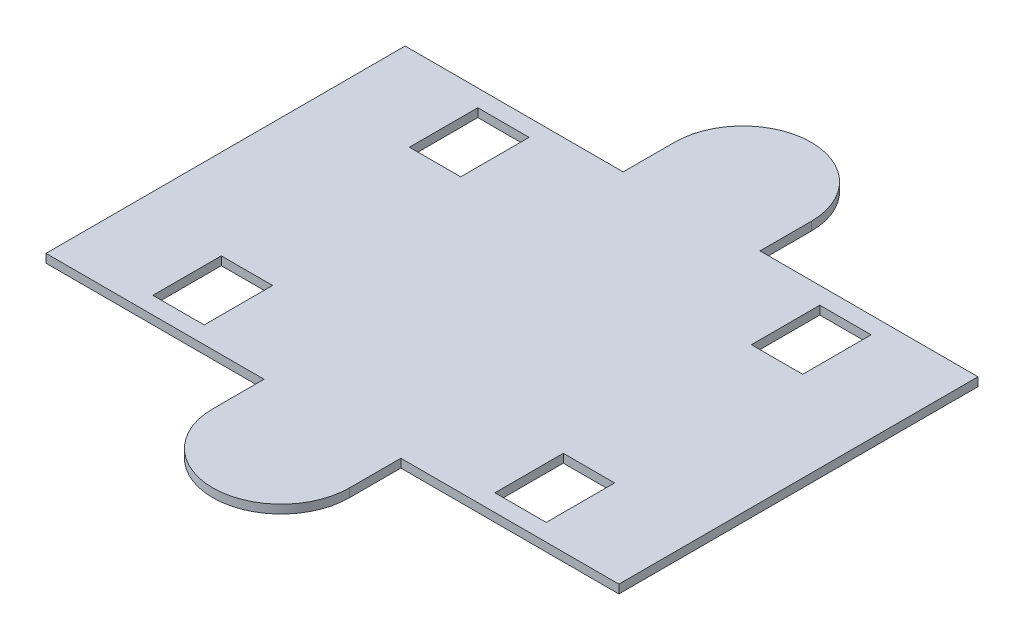
ISO-10303-21;
HEADER;
FILE_DESCRIPTION(('STEP AP214'),'2;1');
FILE_NAME('part.step','',(''),(''),'','','');
FILE_SCHEMA(('AUTOMOTIVE_DESIGN { 1 0 10303 214 1 1 1 1 }'));
ENDSEC;
DATA;
#1=APPLICATION_CONTEXT('core data for automotive mechanical design processes');
#2=APPLICATION_PROTOCOL_DEFINITION('international standard','automotive_design',2000,#1);
#3=PRODUCT_CONTEXT('',#1,'mechanical');
#4=PRODUCT('Part','Part','',(#3));
#5=PRODUCT_RELATED_PRODUCT_CATEGORY('part','',(#4));
#6=PRODUCT_DEFINITION_FORMATION('','',#4);
#7=PRODUCT_DEFINITION_CONTEXT('part definition',#1,'design');
#8=PRODUCT_DEFINITION('design','',#6,#7);
#9=PRODUCT_DEFINITION_SHAPE('','',#8);
#10=(LENGTH_UNIT() NAMED_UNIT(*) SI_UNIT(.MILLI.,.METRE.));
#11=(NAMED_UNIT(*) PLANE_ANGLE_UNIT() SI_UNIT($,.RADIAN.));
#12=(NAMED_UNIT(*) SI_UNIT($,.STERADIAN.) SOLID_ANGLE_UNIT());
#13=UNCERTAINTY_MEASURE_WITH_UNIT(LENGTH_MEASURE(1.E-05),#10,'distance_accuracy_value','');
#14=(GEOMETRIC_REPRESENTATION_CONTEXT(3) GLOBAL_UNCERTAINTY_ASSIGNED_CONTEXT((#13)) GLOBAL_UNIT_ASSIGNED_CONTEXT((#10,
#11,#12)) REPRESENTATION_CONTEXT('',''));
#15=CARTESIAN_POINT('',(0.,0.,0.));
#16=DIRECTION('',(0.,0.,1.));
#17=DIRECTION('',(1.,0.,0.));
#18=AXIS2_PLACEMENT_3D('',#15,#16,#17);
#19=CARTESIAN_POINT('',(-106.3625,0.,66.675));
#20=DIRECTION('',(0.,0.,1.));
#21=DIRECTION('',(1.,0.,0.));
#22=AXIS2_PLACEMENT_3D('',#19,#20,#21);
#23=PLANE('',#22);
#24=DIRECTION('',(1.,0.,0.));
#25=VECTOR('',#24,1.);
#26=CARTESIAN_POINT('',(-106.3625,0.,66.675));
#27=LINE('',#26,#25);
#28=CARTESIAN_POINT('',(-106.3625,0.,66.675));
#29=VERTEX_POINT('',#28);
#30=CARTESIAN_POINT('',(-25.4,0.,66.675));
#31=VERTEX_POINT('',#30);
#32=EDGE_CURVE('E284',#29,#31,#27,.T.);
#33=ORIENTED_EDGE('',*,*,#32,.T.);
#34=DIRECTION('',(0.,1.,0.));
#35=VECTOR('',#34,1.);
#36=CARTESIAN_POINT('',(-25.4,0.,66.675));
#37=LINE('',#36,#35);
#38=CARTESIAN_POINT('',(-25.4,3.175,66.675));
#39=VERTEX_POINT('',#38);
#40=EDGE_CURVE('E248',#31,#39,#37,.T.);
#41=ORIENTED_EDGE('',*,*,#40,.T.);
#42=DIRECTION('',(1.,0.,0.));
#43=VECTOR('',#42,1.);
#44=CARTESIAN_POINT('',(-106.3625,3.175,66.675));
#45=LINE('',#44,#43);
#46=CARTESIAN_POINT('',(-106.3625,3.175,66.675));
#47=VERTEX_POINT('',#46);
#48=EDGE_CURVE('E273',#47,#39,#45,.T.);
#49=ORIENTED_EDGE('',*,*,#48,.F.);
#50=DIRECTION('',(0.,1.,0.));
#51=VECTOR('',#50,1.);
#52=CARTESIAN_POINT('',(-106.3625,0.,66.675));
#53=LINE('',#52,#51);
#54=EDGE_CURVE('E293',#29,#47,#53,.T.);
#55=ORIENTED_EDGE('',*,*,#54,.F.);
#56=EDGE_LOOP('',(#33,#41,#49,#55));
#57=FACE_BOUND('',#56,.T.);
#58=ADVANCED_FACE('F32',(#57),#23,.T.);
#59=CARTESIAN_POINT('',(-106.3625,0.,-66.675));
#60=DIRECTION('',(0.,0.,-1.));
#61=DIRECTION('',(-1.,0.,0.));
#62=AXIS2_PLACEMENT_3D('',#59,#60,#61);
#63=PLANE('',#62);
#64=DIRECTION('',(-1.,0.,0.));
#65=VECTOR('',#64,1.);
#66=CARTESIAN_POINT('',(-106.3625,0.,-66.675));
#67=LINE('',#66,#65);
#68=CARTESIAN_POINT('',(106.3625,0.,-66.675));
#69=VERTEX_POINT('',#68);
#70=CARTESIAN_POINT('',(25.4,0.,-66.675));
#71=VERTEX_POINT('',#70);
#72=EDGE_CURVE('E440',#69,#71,#67,.T.);
#73=ORIENTED_EDGE('',*,*,#72,.T.);
#74=DIRECTION('',(0.,1.,0.));
#75=VECTOR('',#74,1.);
#76=CARTESIAN_POINT('',(25.4,0.,-66.675));
#77=LINE('',#76,#75);
#78=CARTESIAN_POINT('',(25.4,3.175,-66.675));
#79=VERTEX_POINT('',#78);
#80=EDGE_CURVE('E432',#71,#79,#77,.T.);
#81=ORIENTED_EDGE('',*,*,#80,.T.);
#82=DIRECTION('',(-1.,0.,0.));
#83=VECTOR('',#82,1.);
#84=CARTESIAN_POINT('',(-106.3625,3.175,-66.675));
#85=LINE('',#84,#83);
#86=CARTESIAN_POINT('',(106.3625,3.175,-66.675));
#87=VERTEX_POINT('',#86);
#88=EDGE_CURVE('E279',#87,#79,#85,.T.);
#89=ORIENTED_EDGE('',*,*,#88,.F.);
#90=DIRECTION('',(0.,1.,0.));
#91=VECTOR('',#90,1.);
#92=CARTESIAN_POINT('',(106.3625,0.,-66.675));
#93=LINE('',#92,#91);
#94=EDGE_CURVE('E298',#69,#87,#93,.T.);
#95=ORIENTED_EDGE('',*,*,#94,.F.);
#96=EDGE_LOOP('',(#73,#81,#89,#95));
#97=FACE_BOUND('',#96,.T.);
#98=ADVANCED_FACE('F498',(#97),#63,.T.);
#99=CARTESIAN_POINT('',(0.,3.175,0.));
#100=DIRECTION('',(0.,1.,0.));
#101=DIRECTION('',(0.,0.,1.));
#102=AXIS2_PLACEMENT_3D('',#99,#100,#101);
#103=PLANE('',#102);
#104=DIRECTION('',(0.,0.,-1.));
#105=VECTOR('',#104,1.);
#106=CARTESIAN_POINT('',(-53.975,3.175,-60.325));
#107=LINE('',#106,#105);
#108=CARTESIAN_POINT('',(-53.975,3.175,-34.925));
#109=VERTEX_POINT('',#108);
#110=CARTESIAN_POINT('',(-53.975,3.175,-60.325));
#111=VERTEX_POINT('',#110);
#112=EDGE_CURVE('E389',#109,#111,#107,.T.);
#113=ORIENTED_EDGE('',*,*,#112,.F.);
#114=DIRECTION('',(1.,0.,0.));
#115=VECTOR('',#114,1.);
#116=CARTESIAN_POINT('',(-73.025,3.175,-34.925));
#117=LINE('',#116,#115);
#118=CARTESIAN_POINT('',(-73.025,3.175,-34.925));
#119=VERTEX_POINT('',#118);
#120=EDGE_CURVE('E400',#119,#109,#117,.T.);
#121=ORIENTED_EDGE('',*,*,#120,.F.);
#122=DIRECTION('',(0.,0.,1.));
#123=VECTOR('',#122,1.);
#124=CARTESIAN_POINT('',(-73.025,3.175,-60.325));
#125=LINE('',#124,#123);
#126=CARTESIAN_POINT('',(-73.025,3.175,-60.325));
#127=VERTEX_POINT('',#126);
#128=EDGE_CURVE('E414',#127,#119,#125,.T.);
#129=ORIENTED_EDGE('',*,*,#128,.F.);
#130=DIRECTION('',(-1.,0.,0.));
#131=VECTOR('',#130,1.);
#132=CARTESIAN_POINT('',(-73.025,3.175,-60.325));
#133=LINE('',#132,#131);
#134=EDGE_CURVE('E411',#111,#127,#133,.T.);
#135=ORIENTED_EDGE('',*,*,#134,.F.);
#136=EDGE_LOOP('',(#113,#121,#129,#135));
#137=FACE_BOUND('',#136,.T.);
#138=DIRECTION('',(0.,0.,1.));
#139=VECTOR('',#138,1.);
#140=CARTESIAN_POINT('',(-73.025,3.175,60.325));
#141=LINE('',#140,#139);
#142=CARTESIAN_POINT('',(-73.025,3.175,34.925));
#143=VERTEX_POINT('',#142);
#144=CARTESIAN_POINT('',(-73.025,3.175,60.325));
#145=VERTEX_POINT('',#144);
#146=EDGE_CURVE('E357',#143,#145,#141,.T.);
#147=ORIENTED_EDGE('',*,*,#146,.F.);
#148=DIRECTION('',(-1.,0.,0.));
#149=VECTOR('',#148,1.);
#150=CARTESIAN_POINT('',(-73.025,3.175,34.925));
#151=LINE('',#150,#149);
#152=CARTESIAN_POINT('',(-53.975,3.175,34.925));
#153=VERTEX_POINT('',#152);
#154=EDGE_CURVE('E368',#153,#143,#151,.T.);
#155=ORIENTED_EDGE('',*,*,#154,.F.);
#156=DIRECTION('',(0.,0.,-1.));
#157=VECTOR('',#156,1.);
#158=CARTESIAN_POINT('',(-53.975,3.175,60.325));
#159=LINE('',#158,#157);
#160=CARTESIAN_POINT('',(-53.975,3.175,60.325));
#161=VERTEX_POINT('',#160);
#162=EDGE_CURVE('E382',#161,#153,#159,.T.);
#163=ORIENTED_EDGE('',*,*,#162,.F.);
#164=DIRECTION('',(1.,0.,0.));
#165=VECTOR('',#164,1.);
#166=CARTESIAN_POINT('',(-73.025,3.175,60.325));
#167=LINE('',#166,#165);
#168=EDGE_CURVE('E379',#145,#161,#167,.T.);
#169=ORIENTED_EDGE('',*,*,#168,.F.);
#170=EDGE_LOOP('',(#147,#155,#163,#169));
#171=FACE_BOUND('',#170,.T.);
#172=DIRECTION('',(0.,0.,-1.));
#173=VECTOR('',#172,1.);
#174=CARTESIAN_POINT('',(73.025,3.175,60.325));
#175=LINE('',#174,#173);
#176=CARTESIAN_POINT('',(73.025,3.175,60.325));
#177=VERTEX_POINT('',#176);
#178=CARTESIAN_POINT('',(73.025,3.175,34.925));
#179=VERTEX_POINT('',#178);
#180=EDGE_CURVE('E325',#177,#179,#175,.T.);
#181=ORIENTED_EDGE('',*,*,#180,.F.);
#182=DIRECTION('',(1.,0.,0.));
#183=VECTOR('',#182,1.);
#184=CARTESIAN_POINT('',(73.025,3.175,60.325));
#185=LINE('',#184,#183);
#186=CARTESIAN_POINT('',(53.975,3.175,60.325));
#187=VERTEX_POINT('',#186);
#188=EDGE_CURVE('E336',#187,#177,#185,.T.);
#189=ORIENTED_EDGE('',*,*,#188,.F.);
#190=DIRECTION('',(0.,0.,1.));
#191=VECTOR('',#190,1.);
#192=CARTESIAN_POINT('',(53.975,3.175,60.325));
#193=LINE('',#192,#191);
#194=CARTESIAN_POINT('',(53.975,3.175,34.925));
#195=VERTEX_POINT('',#194);
#196=EDGE_CURVE('E350',#195,#187,#193,.T.);
#197=ORIENTED_EDGE('',*,*,#196,.F.);
#198=DIRECTION('',(-1.,0.,0.));
#199=VECTOR('',#198,1.);
#200=CARTESIAN_POINT('',(73.025,3.175,34.925));
#201=LINE('',#200,#199);
#202=EDGE_CURVE('E347',#179,#195,#201,.T.);
#203=ORIENTED_EDGE('',*,*,#202,.F.);
#204=EDGE_LOOP('',(#181,#189,#197,#203));
#205=FACE_BOUND('',#204,.T.);
#206=DIRECTION('',(0.,0.,-1.));
#207=VECTOR('',#206,1.);
#208=CARTESIAN_POINT('',(73.025,3.175,-60.325));
#209=LINE('',#208,#207);
#210=CARTESIAN_POINT('',(73.025,3.175,-34.925));
#211=VERTEX_POINT('',#210);
#212=CARTESIAN_POINT('',(73.025,3.175,-60.325));
#213=VERTEX_POINT('',#212);
#214=EDGE_CURVE('E292',#211,#213,#209,.T.);
#215=ORIENTED_EDGE('',*,*,#214,.F.);
#216=DIRECTION('',(1.,0.,0.));
#217=VECTOR('',#216,1.);
#218=CARTESIAN_POINT('',(73.025,3.175,-34.925));
#219=LINE('',#218,#217);
#220=CARTESIAN_POINT('',(53.975,3.175,-34.925));
#221=VERTEX_POINT('',#220);
#222=EDGE_CURVE('E304',#221,#211,#219,.T.);
#223=ORIENTED_EDGE('',*,*,#222,.F.);
#224=DIRECTION('',(0.,0.,1.));
#225=VECTOR('',#224,1.);
#226=CARTESIAN_POINT('',(53.975,3.175,-60.325));
#227=LINE('',#226,#225);
#228=CARTESIAN_POINT('',(53.975,3.175,-60.325));
#229=VERTEX_POINT('',#228);
#230=EDGE_CURVE('E318',#229,#221,#227,.T.);
#231=ORIENTED_EDGE('',*,*,#230,.F.);
#232=DIRECTION('',(-1.,0.,0.));
#233=VECTOR('',#232,1.);
#234=CARTESIAN_POINT('',(73.025,3.175,-60.325));
#235=LINE('',#234,#233);
#236=EDGE_CURVE('E315',#213,#229,#235,.T.);
#237=ORIENTED_EDGE('',*,*,#236,.F.);
#238=EDGE_LOOP('',(#215,#223,#231,#237));
#239=FACE_BOUND('',#238,.T.);
#240=ORIENTED_EDGE('',*,*,#48,.T.);
#241=DIRECTION('',(0.,0.,1.));
#242=VECTOR('',#241,1.);
#243=CARTESIAN_POINT('',(-25.4,3.175,66.675));
#244=LINE('',#243,#242);
#245=CARTESIAN_POINT('',(-25.4,3.175,85.725));
#246=VERTEX_POINT('',#245);
#247=EDGE_CURVE('E49',#39,#246,#244,.T.);
#248=ORIENTED_EDGE('',*,*,#247,.T.);
#249=CARTESIAN_POINT('',(0.,3.175,85.725));
#250=DIRECTION('',(0.,1.,0.));
#251=DIRECTION('',(0.,0.,-1.));
#252=AXIS2_PLACEMENT_3D('',#249,#250,#251);
#253=CIRCLE('',#252,25.4);
#254=CARTESIAN_POINT('',(25.4,3.175,85.725));
#255=VERTEX_POINT('',#254);
#256=EDGE_CURVE('E245',#246,#255,#253,.T.);
#257=ORIENTED_EDGE('',*,*,#256,.T.);
#258=DIRECTION('',(0.,0.,-1.));
#259=VECTOR('',#258,1.);
#260=CARTESIAN_POINT('',(25.4,3.175,66.675));
#261=LINE('',#260,#259);
#262=CARTESIAN_POINT('',(25.4,3.175,66.675));
#263=VERTEX_POINT('',#262);
#264=EDGE_CURVE('E223',#255,#263,#261,.T.);
#265=ORIENTED_EDGE('',*,*,#264,.T.);
#266=CARTESIAN_POINT('',(106.3625,3.175,66.675));
#267=VERTEX_POINT('',#266);
#268=EDGE_CURVE('E266',#263,#267,#45,.T.);
#269=ORIENTED_EDGE('',*,*,#268,.T.);
#270=DIRECTION('',(0.,0.,-1.));
#271=VECTOR('',#270,1.);
#272=CARTESIAN_POINT('',(106.3625,3.175,66.675));
#273=LINE('',#272,#271);
#274=EDGE_CURVE('E430',#267,#87,#273,.T.);
#275=ORIENTED_EDGE('',*,*,#274,.T.);
#276=ORIENTED_EDGE('',*,*,#88,.T.);
#277=DIRECTION('',(0.,0.,-1.));
#278=VECTOR('',#277,1.);
#279=CARTESIAN_POINT('',(25.4,3.175,-66.675));
#280=LINE('',#279,#278);
#281=CARTESIAN_POINT('',(25.4,3.175,-85.725));
#282=VERTEX_POINT('',#281);
#283=EDGE_CURVE('E57',#79,#282,#280,.T.);
#284=ORIENTED_EDGE('',*,*,#283,.T.);
#285=CARTESIAN_POINT('',(0.,3.175,-85.725));
#286=DIRECTION('',(0.,1.,0.));
#287=DIRECTION('',(0.,0.,1.));
#288=AXIS2_PLACEMENT_3D('',#285,#286,#287);
#289=CIRCLE('',#288,25.4);
#290=CARTESIAN_POINT('',(-25.4,3.175,-85.725));
#291=VERTEX_POINT('',#290);
#292=EDGE_CURVE('E478',#282,#291,#289,.T.);
#293=ORIENTED_EDGE('',*,*,#292,.T.);
#294=DIRECTION('',(0.,0.,1.));
#295=VECTOR('',#294,1.);
#296=CARTESIAN_POINT('',(-25.4,3.175,-66.675));
#297=LINE('',#296,#295);
#298=CARTESIAN_POINT('',(-25.4,3.175,-66.675));
#299=VERTEX_POINT('',#298);
#300=EDGE_CURVE('E475',#291,#299,#297,.T.);
#301=ORIENTED_EDGE('',*,*,#300,.T.);
#302=CARTESIAN_POINT('',(-106.3625,3.175,-66.675));
#303=VERTEX_POINT('',#302);
#304=EDGE_CURVE('E426',#299,#303,#85,.T.);
#305=ORIENTED_EDGE('',*,*,#304,.T.);
#306=DIRECTION('',(0.,0.,1.));
#307=VECTOR('',#306,1.);
#308=CARTESIAN_POINT('',(-106.3625,3.175,66.675));
#309=LINE('',#308,#307);
#310=EDGE_CURVE('E274',#303,#47,#309,.T.);
#311=ORIENTED_EDGE('',*,*,#310,.T.);
#312=EDGE_LOOP('',(#240,#248,#257,#265,#269,#275,#276,#284,#293,#301,#305,#311));
#313=FACE_BOUND('',#312,.T.);
#314=ADVANCED_FACE('F264',(#137,#171,#205,#239,#313),#103,.T.);
#315=CARTESIAN_POINT('',(0.,0.,0.));
#316=DIRECTION('',(0.,1.,0.));
#317=DIRECTION('',(0.,0.,1.));
#318=AXIS2_PLACEMENT_3D('',#315,#316,#317);
#319=PLANE('',#318);
#320=DIRECTION('',(1.,0.,0.));
#321=VECTOR('',#320,1.);
#322=CARTESIAN_POINT('',(-73.025,0.,-34.925));
#323=LINE('',#322,#321);
#324=CARTESIAN_POINT('',(-73.025,0.,-34.925));
#325=VERTEX_POINT('',#324);
#326=CARTESIAN_POINT('',(-53.975,0.,-34.925));
#327=VERTEX_POINT('',#326);
#328=EDGE_CURVE('E406',#325,#327,#323,.T.);
#329=ORIENTED_EDGE('',*,*,#328,.T.);
#330=DIRECTION('',(0.,0.,-1.));
#331=VECTOR('',#330,1.);
#332=CARTESIAN_POINT('',(-53.975,0.,-60.325));
#333=LINE('',#332,#331);
#334=CARTESIAN_POINT('',(-53.975,0.,-60.325));
#335=VERTEX_POINT('',#334);
#336=EDGE_CURVE('E396',#327,#335,#333,.T.);
#337=ORIENTED_EDGE('',*,*,#336,.T.);
#338=DIRECTION('',(-1.,0.,0.));
#339=VECTOR('',#338,1.);
#340=CARTESIAN_POINT('',(-73.025,0.,-60.325));
#341=LINE('',#340,#339);
#342=CARTESIAN_POINT('',(-73.025,0.,-60.325));
#343=VERTEX_POINT('',#342);
#344=EDGE_CURVE('E399',#335,#343,#341,.T.);
#345=ORIENTED_EDGE('',*,*,#344,.T.);
#346=DIRECTION('',(0.,0.,1.));
#347=VECTOR('',#346,1.);
#348=CARTESIAN_POINT('',(-73.025,0.,-60.325));
#349=LINE('',#348,#347);
#350=EDGE_CURVE('E403',#343,#325,#349,.T.);
#351=ORIENTED_EDGE('',*,*,#350,.T.);
#352=EDGE_LOOP('',(#329,#337,#345,#351));
#353=FACE_BOUND('',#352,.T.);
#354=DIRECTION('',(-1.,0.,0.));
#355=VECTOR('',#354,1.);
#356=CARTESIAN_POINT('',(-73.025,0.,34.925));
#357=LINE('',#356,#355);
#358=CARTESIAN_POINT('',(-53.975,0.,34.925));
#359=VERTEX_POINT('',#358);
#360=CARTESIAN_POINT('',(-73.025,0.,34.925));
#361=VERTEX_POINT('',#360);
#362=EDGE_CURVE('E374',#359,#361,#357,.T.);
#363=ORIENTED_EDGE('',*,*,#362,.T.);
#364=DIRECTION('',(0.,0.,1.));
#365=VECTOR('',#364,1.);
#366=CARTESIAN_POINT('',(-73.025,0.,60.325));
#367=LINE('',#366,#365);
#368=CARTESIAN_POINT('',(-73.025,0.,60.325));
#369=VERTEX_POINT('',#368);
#370=EDGE_CURVE('E364',#361,#369,#367,.T.);
#371=ORIENTED_EDGE('',*,*,#370,.T.);
#372=DIRECTION('',(1.,0.,0.));
#373=VECTOR('',#372,1.);
#374=CARTESIAN_POINT('',(-73.025,0.,60.325));
#375=LINE('',#374,#373);
#376=CARTESIAN_POINT('',(-53.975,0.,60.325));
#377=VERTEX_POINT('',#376);
#378=EDGE_CURVE('E367',#369,#377,#375,.T.);
#379=ORIENTED_EDGE('',*,*,#378,.T.);
#380=DIRECTION('',(0.,0.,-1.));
#381=VECTOR('',#380,1.);
#382=CARTESIAN_POINT('',(-53.975,0.,60.325));
#383=LINE('',#382,#381);
#384=EDGE_CURVE('E371',#377,#359,#383,.T.);
#385=ORIENTED_EDGE('',*,*,#384,.T.);
#386=EDGE_LOOP('',(#363,#371,#379,#385));
#387=FACE_BOUND('',#386,.T.);
#388=DIRECTION('',(1.,0.,0.));
#389=VECTOR('',#388,1.);
#390=CARTESIAN_POINT('',(73.025,0.,60.325));
#391=LINE('',#390,#389);
#392=CARTESIAN_POINT('',(53.975,0.,60.325));
#393=VERTEX_POINT('',#392);
#394=CARTESIAN_POINT('',(73.025,0.,60.325));
#395=VERTEX_POINT('',#394);
#396=EDGE_CURVE('E342',#393,#395,#391,.T.);
#397=ORIENTED_EDGE('',*,*,#396,.T.);
#398=DIRECTION('',(0.,0.,-1.));
#399=VECTOR('',#398,1.);
#400=CARTESIAN_POINT('',(73.025,0.,60.325));
#401=LINE('',#400,#399);
#402=CARTESIAN_POINT('',(73.025,0.,34.925));
#403=VERTEX_POINT('',#402);
#404=EDGE_CURVE('E332',#395,#403,#401,.T.);
#405=ORIENTED_EDGE('',*,*,#404,.T.);
#406=DIRECTION('',(-1.,0.,0.));
#407=VECTOR('',#406,1.);
#408=CARTESIAN_POINT('',(73.025,0.,34.925));
#409=LINE('',#408,#407);
#410=CARTESIAN_POINT('',(53.975,0.,34.925));
#411=VERTEX_POINT('',#410);
#412=EDGE_CURVE('E335',#403,#411,#409,.T.);
#413=ORIENTED_EDGE('',*,*,#412,.T.);
#414=DIRECTION('',(0.,0.,1.));
#415=VECTOR('',#414,1.);
#416=CARTESIAN_POINT('',(53.975,0.,60.325));
#417=LINE('',#416,#415);
#418=EDGE_CURVE('E339',#411,#393,#417,.T.);
#419=ORIENTED_EDGE('',*,*,#418,.T.);
#420=EDGE_LOOP('',(#397,#405,#413,#419));
#421=FACE_BOUND('',#420,.T.);
#422=DIRECTION('',(1.,0.,0.));
#423=VECTOR('',#422,1.);
#424=CARTESIAN_POINT('',(73.025,0.,-34.925));
#425=LINE('',#424,#423);
#426=CARTESIAN_POINT('',(53.975,0.,-34.925));
#427=VERTEX_POINT('',#426);
#428=CARTESIAN_POINT('',(73.025,0.,-34.925));
#429=VERTEX_POINT('',#428);
#430=EDGE_CURVE('E310',#427,#429,#425,.T.);
#431=ORIENTED_EDGE('',*,*,#430,.T.);
#432=DIRECTION('',(0.,0.,-1.));
#433=VECTOR('',#432,1.);
#434=CARTESIAN_POINT('',(73.025,0.,-60.325));
#435=LINE('',#434,#433);
#436=CARTESIAN_POINT('',(73.025,0.,-60.325));
#437=VERTEX_POINT('',#436);
#438=EDGE_CURVE('E300',#429,#437,#435,.T.);
#439=ORIENTED_EDGE('',*,*,#438,.T.);
#440=DIRECTION('',(-1.,0.,0.));
#441=VECTOR('',#440,1.);
#442=CARTESIAN_POINT('',(73.025,0.,-60.325));
#443=LINE('',#442,#441);
#444=CARTESIAN_POINT('',(53.975,0.,-60.325));
#445=VERTEX_POINT('',#444);
#446=EDGE_CURVE('E303',#437,#445,#443,.T.);
#447=ORIENTED_EDGE('',*,*,#446,.T.);
#448=DIRECTION('',(0.,0.,1.));
#449=VECTOR('',#448,1.);
#450=CARTESIAN_POINT('',(53.975,0.,-60.325));
#451=LINE('',#450,#449);
#452=EDGE_CURVE('E307',#445,#427,#451,.T.);
#453=ORIENTED_EDGE('',*,*,#452,.T.);
#454=EDGE_LOOP('',(#431,#439,#447,#453));
#455=FACE_BOUND('',#454,.T.);
#456=DIRECTION('',(0.,0.,-1.));
#457=VECTOR('',#456,1.);
#458=CARTESIAN_POINT('',(106.3625,0.,66.675));
#459=LINE('',#458,#457);
#460=CARTESIAN_POINT('',(106.3625,0.,66.675));
#461=VERTEX_POINT('',#460);
#462=EDGE_CURVE('E276',#461,#69,#459,.T.);
#463=ORIENTED_EDGE('',*,*,#462,.F.);
#464=CARTESIAN_POINT('',(25.4,0.,66.675));
#465=VERTEX_POINT('',#464);
#466=EDGE_CURVE('E238',#465,#461,#27,.T.);
#467=ORIENTED_EDGE('',*,*,#466,.F.);
#468=DIRECTION('',(0.,0.,-1.));
#469=VECTOR('',#468,1.);
#470=CARTESIAN_POINT('',(25.4,0.,66.675));
#471=LINE('',#470,#469);
#472=CARTESIAN_POINT('',(25.4,0.,85.725));
#473=VERTEX_POINT('',#472);
#474=EDGE_CURVE('E220',#473,#465,#471,.T.);
#475=ORIENTED_EDGE('',*,*,#474,.F.);
#476=CARTESIAN_POINT('',(0.,0.,85.725));
#477=DIRECTION('',(0.,1.,0.));
#478=DIRECTION('',(0.,0.,-1.));
#479=AXIS2_PLACEMENT_3D('',#476,#477,#478);
#480=CIRCLE('',#479,25.4);
#481=CARTESIAN_POINT('',(-25.4,0.,85.725));
#482=VERTEX_POINT('',#481);
#483=EDGE_CURVE('E236',#482,#473,#480,.T.);
#484=ORIENTED_EDGE('',*,*,#483,.F.);
#485=DIRECTION('',(0.,0.,1.));
#486=VECTOR('',#485,1.);
#487=CARTESIAN_POINT('',(-25.4,0.,66.675));
#488=LINE('',#487,#486);
#489=EDGE_CURVE('E229',#31,#482,#488,.T.);
#490=ORIENTED_EDGE('',*,*,#489,.F.);
#491=ORIENTED_EDGE('',*,*,#32,.F.);
#492=DIRECTION('',(0.,0.,1.));
#493=VECTOR('',#492,1.);
#494=CARTESIAN_POINT('',(-106.3625,0.,66.675));
#495=LINE('',#494,#493);
#496=CARTESIAN_POINT('',(-106.3625,0.,-66.675));
#497=VERTEX_POINT('',#496);
#498=EDGE_CURVE('E435',#497,#29,#495,.T.);
#499=ORIENTED_EDGE('',*,*,#498,.F.);
#500=CARTESIAN_POINT('',(-25.4,0.,-66.675));
#501=VERTEX_POINT('',#500);
#502=EDGE_CURVE('E446',#501,#497,#67,.T.);
#503=ORIENTED_EDGE('',*,*,#502,.F.);
#504=DIRECTION('',(0.,0.,1.));
#505=VECTOR('',#504,1.);
#506=CARTESIAN_POINT('',(-25.4,0.,-66.675));
#507=LINE('',#506,#505);
#508=CARTESIAN_POINT('',(-25.4,0.,-85.725));
#509=VERTEX_POINT('',#508);
#510=EDGE_CURVE('E459',#509,#501,#507,.T.);
#511=ORIENTED_EDGE('',*,*,#510,.F.);
#512=CARTESIAN_POINT('',(0.,0.,-85.725));
#513=DIRECTION('',(0.,1.,0.));
#514=DIRECTION('',(0.,0.,1.));
#515=AXIS2_PLACEMENT_3D('',#512,#513,#514);
#516=CIRCLE('',#515,25.4);
#517=CARTESIAN_POINT('',(25.4,0.,-85.725));
#518=VERTEX_POINT('',#517);
#519=EDGE_CURVE('E472',#518,#509,#516,.T.);
#520=ORIENTED_EDGE('',*,*,#519,.F.);
#521=DIRECTION('',(0.,0.,-1.));
#522=VECTOR('',#521,1.);
#523=CARTESIAN_POINT('',(25.4,0.,-66.675));
#524=LINE('',#523,#522);
#525=EDGE_CURVE('E477',#71,#518,#524,.T.);
#526=ORIENTED_EDGE('',*,*,#525,.F.);
#527=ORIENTED_EDGE('',*,*,#72,.F.);
#528=EDGE_LOOP('',(#463,#467,#475,#484,#490,#491,#499,#503,#511,#520,#526,#527));
#529=FACE_BOUND('',#528,.T.);
#530=ADVANCED_FACE('F34',(#353,#387,#421,#455,#529),#319,.F.);
#531=CARTESIAN_POINT('',(-53.975,0.,-60.325));
#532=DIRECTION('',(1.,0.,0.));
#533=DIRECTION('',(0.,0.,-1.));
#534=AXIS2_PLACEMENT_3D('',#531,#532,#533);
#535=PLANE('',#534);
#536=ORIENTED_EDGE('',*,*,#112,.T.);
#537=DIRECTION('',(0.,1.,0.));
#538=VECTOR('',#537,1.);
#539=CARTESIAN_POINT('',(-53.975,0.,-60.325));
#540=LINE('',#539,#538);
#541=EDGE_CURVE('E409',#335,#111,#540,.T.);
#542=ORIENTED_EDGE('',*,*,#541,.F.);
#543=ORIENTED_EDGE('',*,*,#336,.F.);
#544=DIRECTION('',(0.,1.,0.));
#545=VECTOR('',#544,1.);
#546=CARTESIAN_POINT('',(-53.975,0.,-34.925));
#547=LINE('',#546,#545);
#548=EDGE_CURVE('E12',#327,#109,#547,.T.);
#549=ORIENTED_EDGE('',*,*,#548,.T.);
#550=EDGE_LOOP('',(#536,#542,#543,#549));
#551=FACE_BOUND('',#550,.T.);
#552=ADVANCED_FACE('F586',(#551),#535,.F.);
#553=CARTESIAN_POINT('',(-73.025,0.,-34.925));
#554=DIRECTION('',(0.,0.,1.));
#555=DIRECTION('',(1.,0.,0.));
#556=AXIS2_PLACEMENT_3D('',#553,#554,#555);
#557=PLANE('',#556);
#558=ORIENTED_EDGE('',*,*,#120,.T.);
#559=ORIENTED_EDGE('',*,*,#548,.F.);
#560=ORIENTED_EDGE('',*,*,#328,.F.);
#561=DIRECTION('',(0.,1.,0.));
#562=VECTOR('',#561,1.);
#563=CARTESIAN_POINT('',(-73.025,0.,-34.925));
#564=LINE('',#563,#562);
#565=EDGE_CURVE('E41',#325,#119,#564,.T.);
#566=ORIENTED_EDGE('',*,*,#565,.T.);
#567=EDGE_LOOP('',(#558,#559,#560,#566));
#568=FACE_BOUND('',#567,.T.);
#569=ADVANCED_FACE('F768',(#568),#557,.F.);
#570=CARTESIAN_POINT('',(-73.025,0.,-60.325));
#571=DIRECTION('',(-1.,0.,0.));
#572=DIRECTION('',(0.,0.,1.));
#573=AXIS2_PLACEMENT_3D('',#570,#571,#572);
#574=PLANE('',#573);
#575=ORIENTED_EDGE('',*,*,#128,.T.);
#576=ORIENTED_EDGE('',*,*,#565,.F.);
#577=ORIENTED_EDGE('',*,*,#350,.F.);
#578=DIRECTION('',(0.,1.,0.));
#579=VECTOR('',#578,1.);
#580=CARTESIAN_POINT('',(-73.025,0.,-60.325));
#581=LINE('',#580,#579);
#582=EDGE_CURVE('E420',#343,#127,#581,.T.);
#583=ORIENTED_EDGE('',*,*,#582,.T.);
#584=EDGE_LOOP('',(#575,#576,#577,#583));
#585=FACE_BOUND('',#584,.T.);
#586=ADVANCED_FACE('F758',(#585),#574,.F.);
#587=CARTESIAN_POINT('',(-73.025,0.,-60.325));
#588=DIRECTION('',(0.,0.,-1.));
#589=DIRECTION('',(-1.,0.,0.));
#590=AXIS2_PLACEMENT_3D('',#587,#588,#589);
#591=PLANE('',#590);
#592=ORIENTED_EDGE('',*,*,#134,.T.);
#593=ORIENTED_EDGE('',*,*,#582,.F.);
#594=ORIENTED_EDGE('',*,*,#344,.F.);
#595=ORIENTED_EDGE('',*,*,#541,.T.);
#596=EDGE_LOOP('',(#592,#593,#594,#595));
#597=FACE_BOUND('',#596,.T.);
#598=ADVANCED_FACE('F748',(#597),#591,.F.);
#599=CARTESIAN_POINT('',(-73.025,0.,60.325));
#600=DIRECTION('',(-1.,0.,0.));
#601=DIRECTION('',(0.,0.,1.));
#602=AXIS2_PLACEMENT_3D('',#599,#600,#601);
#603=PLANE('',#602);
#604=ORIENTED_EDGE('',*,*,#146,.T.);
#605=DIRECTION('',(0.,1.,0.));
#606=VECTOR('',#605,1.);
#607=CARTESIAN_POINT('',(-73.025,0.,60.325));
#608=LINE('',#607,#606);
#609=EDGE_CURVE('E377',#369,#145,#608,.T.);
#610=ORIENTED_EDGE('',*,*,#609,.F.);
#611=ORIENTED_EDGE('',*,*,#370,.F.);
#612=DIRECTION('',(0.,1.,0.));
#613=VECTOR('',#612,1.);
#614=CARTESIAN_POINT('',(-73.025,0.,34.925));
#615=LINE('',#614,#613);
#616=EDGE_CURVE('E387',#361,#143,#615,.T.);
#617=ORIENTED_EDGE('',*,*,#616,.T.);
#618=EDGE_LOOP('',(#604,#610,#611,#617));
#619=FACE_BOUND('',#618,.T.);
#620=ADVANCED_FACE('F738',(#619),#603,.F.);
#621=CARTESIAN_POINT('',(-73.025,0.,34.925));
#622=DIRECTION('',(0.,0.,-1.));
#623=DIRECTION('',(-1.,0.,0.));
#624=AXIS2_PLACEMENT_3D('',#621,#622,#623);
#625=PLANE('',#624);
#626=ORIENTED_EDGE('',*,*,#154,.T.);
#627=ORIENTED_EDGE('',*,*,#616,.F.);
#628=ORIENTED_EDGE('',*,*,#362,.F.);
#629=DIRECTION('',(0.,1.,0.));
#630=VECTOR('',#629,1.);
#631=CARTESIAN_POINT('',(-53.975,0.,34.925));
#632=LINE('',#631,#630);
#633=EDGE_CURVE('E390',#359,#153,#632,.T.);
#634=ORIENTED_EDGE('',*,*,#633,.T.);
#635=EDGE_LOOP('',(#626,#627,#628,#634));
#636=FACE_BOUND('',#635,.T.);
#637=ADVANCED_FACE('F728',(#636),#625,.F.);
#638=CARTESIAN_POINT('',(-53.975,0.,60.325));
#639=DIRECTION('',(1.,0.,0.));
#640=DIRECTION('',(0.,0.,-1.));
#641=AXIS2_PLACEMENT_3D('',#638,#639,#640);
#642=PLANE('',#641);
#643=ORIENTED_EDGE('',*,*,#162,.T.);
#644=ORIENTED_EDGE('',*,*,#633,.F.);
#645=ORIENTED_EDGE('',*,*,#384,.F.);
#646=DIRECTION('',(0.,1.,0.));
#647=VECTOR('',#646,1.);
#648=CARTESIAN_POINT('',(-53.975,0.,60.325));
#649=LINE('',#648,#647);
#650=EDGE_CURVE('E392',#377,#161,#649,.T.);
#651=ORIENTED_EDGE('',*,*,#650,.T.);
#652=EDGE_LOOP('',(#643,#644,#645,#651));
#653=FACE_BOUND('',#652,.T.);
#654=ADVANCED_FACE('F718',(#653),#642,.F.);
#655=CARTESIAN_POINT('',(-73.025,0.,60.325));
#656=DIRECTION('',(0.,0.,1.));
#657=DIRECTION('',(1.,0.,0.));
#658=AXIS2_PLACEMENT_3D('',#655,#656,#657);
#659=PLANE('',#658);
#660=ORIENTED_EDGE('',*,*,#168,.T.);
#661=ORIENTED_EDGE('',*,*,#650,.F.);
#662=ORIENTED_EDGE('',*,*,#378,.F.);
#663=ORIENTED_EDGE('',*,*,#609,.T.);
#664=EDGE_LOOP('',(#660,#661,#662,#663));
#665=FACE_BOUND('',#664,.T.);
#666=ADVANCED_FACE('F708',(#665),#659,.F.);
#667=CARTESIAN_POINT('',(73.025,0.,60.325));
#668=DIRECTION('',(1.,0.,0.));
#669=DIRECTION('',(0.,0.,-1.));
#670=AXIS2_PLACEMENT_3D('',#667,#668,#669);
#671=PLANE('',#670);
#672=ORIENTED_EDGE('',*,*,#180,.T.);
#673=DIRECTION('',(0.,1.,0.));
#674=VECTOR('',#673,1.);
#675=CARTESIAN_POINT('',(73.025,0.,34.925));
#676=LINE('',#675,#674);
#677=EDGE_CURVE('E345',#403,#179,#676,.T.);
#678=ORIENTED_EDGE('',*,*,#677,.F.);
#679=ORIENTED_EDGE('',*,*,#404,.F.);
#680=DIRECTION('',(0.,1.,0.));
#681=VECTOR('',#680,1.);
#682=CARTESIAN_POINT('',(73.025,0.,60.325));
#683=LINE('',#682,#681);
#684=EDGE_CURVE('E355',#395,#177,#683,.T.);
#685=ORIENTED_EDGE('',*,*,#684,.T.);
#686=EDGE_LOOP('',(#672,#678,#679,#685));
#687=FACE_BOUND('',#686,.T.);
#688=ADVANCED_FACE('F698',(#687),#671,.F.);
#689=CARTESIAN_POINT('',(73.025,0.,60.325));
#690=DIRECTION('',(0.,0.,1.));
#691=DIRECTION('',(1.,0.,0.));
#692=AXIS2_PLACEMENT_3D('',#689,#690,#691);
#693=PLANE('',#692);
#694=ORIENTED_EDGE('',*,*,#188,.T.);
#695=ORIENTED_EDGE('',*,*,#684,.F.);
#696=ORIENTED_EDGE('',*,*,#396,.F.);
#697=DIRECTION('',(0.,1.,0.));
#698=VECTOR('',#697,1.);
#699=CARTESIAN_POINT('',(53.975,0.,60.325));
#700=LINE('',#699,#698);
#701=EDGE_CURVE('E358',#393,#187,#700,.T.);
#702=ORIENTED_EDGE('',*,*,#701,.T.);
#703=EDGE_LOOP('',(#694,#695,#696,#702));
#704=FACE_BOUND('',#703,.T.);
#705=ADVANCED_FACE('F688',(#704),#693,.F.);
#706=CARTESIAN_POINT('',(53.975,0.,60.325));
#707=DIRECTION('',(-1.,0.,0.));
#708=DIRECTION('',(0.,0.,1.));
#709=AXIS2_PLACEMENT_3D('',#706,#707,#708);
#710=PLANE('',#709);
#711=ORIENTED_EDGE('',*,*,#196,.T.);
#712=ORIENTED_EDGE('',*,*,#701,.F.);
#713=ORIENTED_EDGE('',*,*,#418,.F.);
#714=DIRECTION('',(0.,1.,0.));
#715=VECTOR('',#714,1.);
#716=CARTESIAN_POINT('',(53.975,0.,34.925));
#717=LINE('',#716,#715);
#718=EDGE_CURVE('E360',#411,#195,#717,.T.);
#719=ORIENTED_EDGE('',*,*,#718,.T.);
#720=EDGE_LOOP('',(#711,#712,#713,#719));
#721=FACE_BOUND('',#720,.T.);
#722=ADVANCED_FACE('F678',(#721),#710,.F.);
#723=CARTESIAN_POINT('',(73.025,0.,34.925));
#724=DIRECTION('',(0.,0.,-1.));
#725=DIRECTION('',(-1.,0.,0.));
#726=AXIS2_PLACEMENT_3D('',#723,#724,#725);
#727=PLANE('',#726);
#728=ORIENTED_EDGE('',*,*,#202,.T.);
#729=ORIENTED_EDGE('',*,*,#718,.F.);
#730=ORIENTED_EDGE('',*,*,#412,.F.);
#731=ORIENTED_EDGE('',*,*,#677,.T.);
#732=EDGE_LOOP('',(#728,#729,#730,#731));
#733=FACE_BOUND('',#732,.T.);
#734=ADVANCED_FACE('F668',(#733),#727,.F.);
#735=CARTESIAN_POINT('',(73.025,0.,-60.325));
#736=DIRECTION('',(1.,0.,0.));
#737=DIRECTION('',(0.,0.,-1.));
#738=AXIS2_PLACEMENT_3D('',#735,#736,#737);
#739=PLANE('',#738);
#740=ORIENTED_EDGE('',*,*,#214,.T.);
#741=DIRECTION('',(0.,1.,0.));
#742=VECTOR('',#741,1.);
#743=CARTESIAN_POINT('',(73.025,0.,-60.325));
#744=LINE('',#743,#742);
#745=EDGE_CURVE('E313',#437,#213,#744,.T.);
#746=ORIENTED_EDGE('',*,*,#745,.F.);
#747=ORIENTED_EDGE('',*,*,#438,.F.);
#748=DIRECTION('',(0.,1.,0.));
#749=VECTOR('',#748,1.);
#750=CARTESIAN_POINT('',(73.025,0.,-34.925));
#751=LINE('',#750,#749);
#752=EDGE_CURVE('E323',#429,#211,#751,.T.);
#753=ORIENTED_EDGE('',*,*,#752,.T.);
#754=EDGE_LOOP('',(#740,#746,#747,#753));
#755=FACE_BOUND('',#754,.T.);
#756=ADVANCED_FACE('F659',(#755),#739,.F.);
#757=CARTESIAN_POINT('',(73.025,0.,-34.925));
#758=DIRECTION('',(0.,0.,1.));
#759=DIRECTION('',(1.,0.,0.));
#760=AXIS2_PLACEMENT_3D('',#757,#758,#759);
#761=PLANE('',#760);
#762=ORIENTED_EDGE('',*,*,#222,.T.);
#763=ORIENTED_EDGE('',*,*,#752,.F.);
#764=ORIENTED_EDGE('',*,*,#430,.F.);
#765=DIRECTION('',(0.,1.,0.));
#766=VECTOR('',#765,1.);
#767=CARTESIAN_POINT('',(53.975,0.,-34.925));
#768=LINE('',#767,#766);
#769=EDGE_CURVE('E326',#427,#221,#768,.T.);
#770=ORIENTED_EDGE('',*,*,#769,.T.);
#771=EDGE_LOOP('',(#762,#763,#764,#770));
#772=FACE_BOUND('',#771,.T.);
#773=ADVANCED_FACE('F649',(#772),#761,.F.);
#774=CARTESIAN_POINT('',(53.975,0.,-60.325));
#775=DIRECTION('',(-1.,0.,0.));
#776=DIRECTION('',(0.,0.,1.));
#777=AXIS2_PLACEMENT_3D('',#774,#775,#776);
#778=PLANE('',#777);
#779=ORIENTED_EDGE('',*,*,#230,.T.);
#780=ORIENTED_EDGE('',*,*,#769,.F.);
#781=ORIENTED_EDGE('',*,*,#452,.F.);
#782=DIRECTION('',(0.,1.,0.));
#783=VECTOR('',#782,1.);
#784=CARTESIAN_POINT('',(53.975,0.,-60.325));
#785=LINE('',#784,#783);
#786=EDGE_CURVE('E328',#445,#229,#785,.T.);
#787=ORIENTED_EDGE('',*,*,#786,.T.);
#788=EDGE_LOOP('',(#779,#780,#781,#787));
#789=FACE_BOUND('',#788,.T.);
#790=ADVANCED_FACE('F510',(#789),#778,.F.);
#791=CARTESIAN_POINT('',(73.025,0.,-60.325));
#792=DIRECTION('',(0.,0.,-1.));
#793=DIRECTION('',(-1.,0.,0.));
#794=AXIS2_PLACEMENT_3D('',#791,#792,#793);
#795=PLANE('',#794);
#796=ORIENTED_EDGE('',*,*,#236,.T.);
#797=ORIENTED_EDGE('',*,*,#786,.F.);
#798=ORIENTED_EDGE('',*,*,#446,.F.);
#799=ORIENTED_EDGE('',*,*,#745,.T.);
#800=EDGE_LOOP('',(#796,#797,#798,#799));
#801=FACE_BOUND('',#800,.T.);
#802=ADVANCED_FACE('F502',(#801),#795,.F.);
#803=CARTESIAN_POINT('',(106.3625,0.,66.675));
#804=DIRECTION('',(1.,0.,0.));
#805=DIRECTION('',(0.,0.,-1.));
#806=AXIS2_PLACEMENT_3D('',#803,#804,#805);
#807=PLANE('',#806);
#808=ORIENTED_EDGE('',*,*,#274,.F.);
#809=DIRECTION('',(0.,1.,0.));
#810=VECTOR('',#809,1.);
#811=CARTESIAN_POINT('',(106.3625,0.,66.675));
#812=LINE('',#811,#810);
#813=EDGE_CURVE('E271',#461,#267,#812,.T.);
#814=ORIENTED_EDGE('',*,*,#813,.F.);
#815=ORIENTED_EDGE('',*,*,#462,.T.);
#816=ORIENTED_EDGE('',*,*,#94,.T.);
#817=EDGE_LOOP('',(#808,#814,#815,#816));
#818=FACE_BOUND('',#817,.T.);
#819=ADVANCED_FACE('F500',(#818),#807,.T.);
#820=DIRECTION('',(0.,1.,0.));
#821=VECTOR('',#820,1.);
#822=CARTESIAN_POINT('',(25.4,0.,66.675));
#823=LINE('',#822,#821);
#824=EDGE_CURVE('E228',#465,#263,#823,.T.);
#825=ORIENTED_EDGE('',*,*,#824,.F.);
#826=ORIENTED_EDGE('',*,*,#466,.T.);
#827=ORIENTED_EDGE('',*,*,#813,.T.);
#828=ORIENTED_EDGE('',*,*,#268,.F.);
#829=EDGE_LOOP('',(#825,#826,#827,#828));
#830=FACE_BOUND('',#829,.T.);
#831=ADVANCED_FACE('F269',(#830),#23,.T.);
#832=CARTESIAN_POINT('',(-106.3625,0.,66.675));
#833=DIRECTION('',(-1.,0.,0.));
#834=DIRECTION('',(0.,0.,1.));
#835=AXIS2_PLACEMENT_3D('',#832,#833,#834);
#836=PLANE('',#835);
#837=ORIENTED_EDGE('',*,*,#310,.F.);
#838=DIRECTION('',(0.,1.,0.));
#839=VECTOR('',#838,1.);
#840=CARTESIAN_POINT('',(-106.3625,0.,-66.675));
#841=LINE('',#840,#839);
#842=EDGE_CURVE('E295',#497,#303,#841,.T.);
#843=ORIENTED_EDGE('',*,*,#842,.F.);
#844=ORIENTED_EDGE('',*,*,#498,.T.);
#845=ORIENTED_EDGE('',*,*,#54,.T.);
#846=EDGE_LOOP('',(#837,#843,#844,#845));
#847=FACE_BOUND('',#846,.T.);
#848=ADVANCED_FACE('F508',(#847),#836,.T.);
#849=DIRECTION('',(0.,1.,0.));
#850=VECTOR('',#849,1.);
#851=CARTESIAN_POINT('',(-25.4,0.,-66.675));
#852=LINE('',#851,#850);
#853=EDGE_CURVE('E461',#501,#299,#852,.T.);
#854=ORIENTED_EDGE('',*,*,#853,.F.);
#855=ORIENTED_EDGE('',*,*,#502,.T.);
#856=ORIENTED_EDGE('',*,*,#842,.T.);
#857=ORIENTED_EDGE('',*,*,#304,.F.);
#858=EDGE_LOOP('',(#854,#855,#856,#857));
#859=FACE_BOUND('',#858,.T.);
#860=ADVANCED_FACE('F520',(#859),#63,.T.);
#861=CARTESIAN_POINT('',(25.4,0.,-66.675));
#862=DIRECTION('',(1.,0.,0.));
#863=DIRECTION('',(0.,0.,-1.));
#864=AXIS2_PLACEMENT_3D('',#861,#862,#863);
#865=PLANE('',#864);
#866=ORIENTED_EDGE('',*,*,#283,.F.);
#867=ORIENTED_EDGE('',*,*,#80,.F.);
#868=ORIENTED_EDGE('',*,*,#525,.T.);
#869=DIRECTION('',(0.,1.,0.));
#870=VECTOR('',#869,1.);
#871=CARTESIAN_POINT('',(25.4,0.,-85.725));
#872=LINE('',#871,#870);
#873=EDGE_CURVE('E456',#518,#282,#872,.T.);
#874=ORIENTED_EDGE('',*,*,#873,.T.);
#875=EDGE_LOOP('',(#866,#867,#868,#874));
#876=FACE_BOUND('',#875,.T.);
#877=ADVANCED_FACE('F493',(#876),#865,.T.);
#878=CARTESIAN_POINT('',(-25.4,0.,-66.675));
#879=DIRECTION('',(-1.,0.,0.));
#880=DIRECTION('',(0.,0.,1.));
#881=AXIS2_PLACEMENT_3D('',#878,#879,#880);
#882=PLANE('',#881);
#883=ORIENTED_EDGE('',*,*,#300,.F.);
#884=DIRECTION('',(0.,1.,0.));
#885=VECTOR('',#884,1.);
#886=CARTESIAN_POINT('',(-25.4,0.,-85.725));
#887=LINE('',#886,#885);
#888=EDGE_CURVE('E458',#509,#291,#887,.T.);
#889=ORIENTED_EDGE('',*,*,#888,.F.);
#890=ORIENTED_EDGE('',*,*,#510,.T.);
#891=ORIENTED_EDGE('',*,*,#853,.T.);
#892=EDGE_LOOP('',(#883,#889,#890,#891));
#893=FACE_BOUND('',#892,.T.);
#894=ADVANCED_FACE('F530',(#893),#882,.T.);
#895=CARTESIAN_POINT('',(0.,0.,-85.725));
#896=DIRECTION('',(0.,1.,0.));
#897=DIRECTION('',(0.,0.,1.));
#898=AXIS2_PLACEMENT_3D('',#895,#896,#897);
#899=CYLINDRICAL_SURFACE('',#898,25.4);
#900=ORIENTED_EDGE('',*,*,#292,.F.);
#901=ORIENTED_EDGE('',*,*,#873,.F.);
#902=ORIENTED_EDGE('',*,*,#519,.T.);
#903=ORIENTED_EDGE('',*,*,#888,.T.);
#904=EDGE_LOOP('',(#900,#901,#902,#903));
#905=FACE_BOUND('',#904,.T.);
#906=ADVANCED_FACE('F489',(#905),#899,.T.);
#907=CARTESIAN_POINT('',(0.,0.,85.725));
#908=DIRECTION('',(0.,1.,0.));
#909=DIRECTION('',(0.,0.,1.));
#910=AXIS2_PLACEMENT_3D('',#907,#908,#909);
#911=CYLINDRICAL_SURFACE('',#910,25.4);
#912=ORIENTED_EDGE('',*,*,#256,.F.);
#913=DIRECTION('',(0.,1.,0.));
#914=VECTOR('',#913,1.);
#915=CARTESIAN_POINT('',(-25.4,0.,85.725));
#916=LINE('',#915,#914);
#917=EDGE_CURVE('E241',#482,#246,#916,.T.);
#918=ORIENTED_EDGE('',*,*,#917,.F.);
#919=ORIENTED_EDGE('',*,*,#483,.T.);
#920=DIRECTION('',(0.,1.,0.));
#921=VECTOR('',#920,1.);
#922=CARTESIAN_POINT('',(25.4,0.,85.725));
#923=LINE('',#922,#921);
#924=EDGE_CURVE('E217',#473,#255,#923,.T.);
#925=ORIENTED_EDGE('',*,*,#924,.T.);
#926=EDGE_LOOP('',(#912,#918,#919,#925));
#927=FACE_BOUND('',#926,.T.);
#928=ADVANCED_FACE('F240',(#927),#911,.T.);
#929=CARTESIAN_POINT('',(-25.4,0.,66.675));
#930=DIRECTION('',(-1.,0.,0.));
#931=DIRECTION('',(0.,0.,1.));
#932=AXIS2_PLACEMENT_3D('',#929,#930,#931);
#933=PLANE('',#932);
#934=ORIENTED_EDGE('',*,*,#247,.F.);
#935=ORIENTED_EDGE('',*,*,#40,.F.);
#936=ORIENTED_EDGE('',*,*,#489,.T.);
#937=ORIENTED_EDGE('',*,*,#917,.T.);
#938=EDGE_LOOP('',(#934,#935,#936,#937));
#939=FACE_BOUND('',#938,.T.);
#940=ADVANCED_FACE('F535',(#939),#933,.T.);
#941=CARTESIAN_POINT('',(25.4,0.,66.675));
#942=DIRECTION('',(1.,0.,0.));
#943=DIRECTION('',(0.,0.,-1.));
#944=AXIS2_PLACEMENT_3D('',#941,#942,#943);
#945=PLANE('',#944);
#946=ORIENTED_EDGE('',*,*,#264,.F.);
#947=ORIENTED_EDGE('',*,*,#924,.F.);
#948=ORIENTED_EDGE('',*,*,#474,.T.);
#949=ORIENTED_EDGE('',*,*,#824,.T.);
#950=EDGE_LOOP('',(#946,#947,#948,#949));
#951=FACE_BOUND('',#950,.T.);
#952=ADVANCED_FACE('F219',(#951),#945,.T.);
#953=CLOSED_SHELL('',(#58,#98,#314,#530,#552,#569,#586,#598,#620,#637,#654,#666,#688,#705,#722,
#734,#756,#773,#790,#802,#819,#831,#848,#860,#877,#894,#906,#928,#940,#952));
#954=MANIFOLD_SOLID_BREP('B2',#953);
#955=ADVANCED_BREP_SHAPE_REPRESENTATION('',(#18,#954),#14);
#956=SHAPE_DEFINITION_REPRESENTATION(#9,#955);
ENDSEC;
END-ISO-10303-21;
